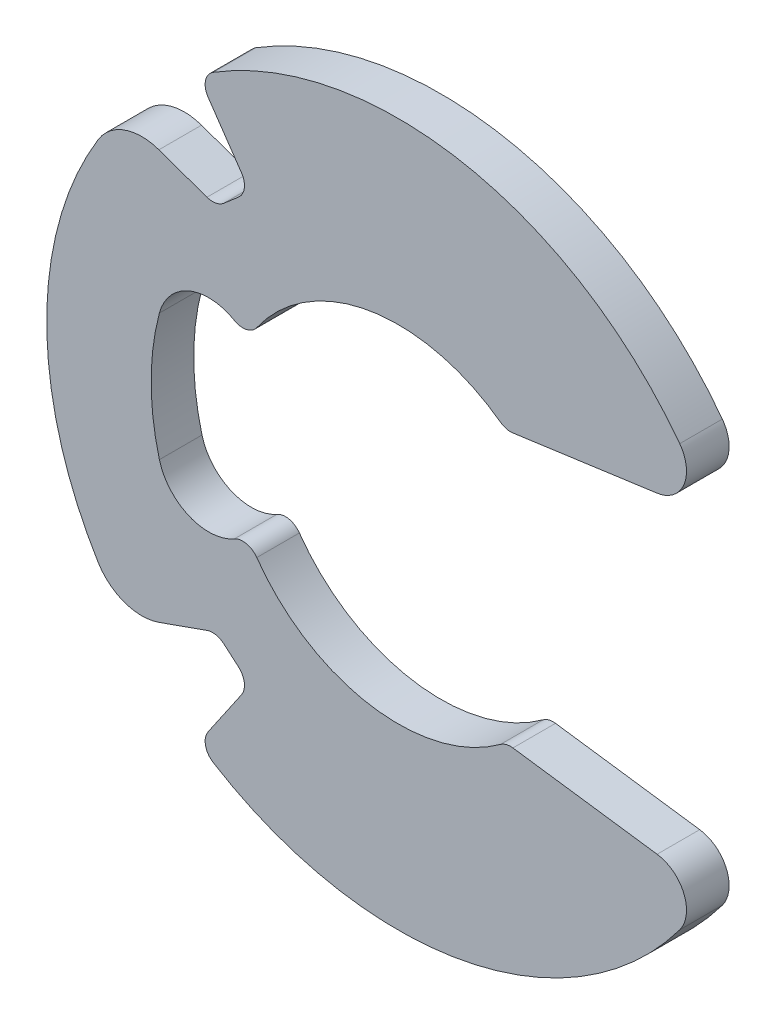
ISO-10303-21;
HEADER;
FILE_DESCRIPTION(('STEP AP214'),'2;1');
FILE_NAME('part.step','',(''),(''),'','','');
FILE_SCHEMA(('AUTOMOTIVE_DESIGN { 1 0 10303 214 1 1 1 1 }'));
ENDSEC;
DATA;
#1=APPLICATION_CONTEXT('core data for automotive mechanical design processes');
#2=APPLICATION_PROTOCOL_DEFINITION('international standard','automotive_design',2000,#1);
#3=PRODUCT_CONTEXT('',#1,'mechanical');
#4=PRODUCT('Part','Part','',(#3));
#5=PRODUCT_RELATED_PRODUCT_CATEGORY('part','',(#4));
#6=PRODUCT_DEFINITION_FORMATION('','',#4);
#7=PRODUCT_DEFINITION_CONTEXT('part definition',#1,'design');
#8=PRODUCT_DEFINITION('design','',#6,#7);
#9=PRODUCT_DEFINITION_SHAPE('','',#8);
#10=(LENGTH_UNIT() NAMED_UNIT(*) SI_UNIT(.MILLI.,.METRE.));
#11=(NAMED_UNIT(*) PLANE_ANGLE_UNIT() SI_UNIT($,.RADIAN.));
#12=(NAMED_UNIT(*) SI_UNIT($,.STERADIAN.) SOLID_ANGLE_UNIT());
#13=UNCERTAINTY_MEASURE_WITH_UNIT(LENGTH_MEASURE(1.E-05),#10,'distance_accuracy_value','');
#14=(GEOMETRIC_REPRESENTATION_CONTEXT(3) GLOBAL_UNCERTAINTY_ASSIGNED_CONTEXT((#13)) GLOBAL_UNIT_ASSIGNED_CONTEXT((#10,
#11,#12)) REPRESENTATION_CONTEXT('',''));
#15=CARTESIAN_POINT('',(0.,0.,0.));
#16=DIRECTION('',(0.,0.,1.));
#17=DIRECTION('',(1.,0.,0.));
#18=AXIS2_PLACEMENT_3D('',#15,#16,#17);
#19=CARTESIAN_POINT('',(0.,0.,1.27));
#20=DIRECTION('',(0.,0.,-1.));
#21=DIRECTION('',(-1.,0.,0.));
#22=AXIS2_PLACEMENT_3D('',#19,#20,#21);
#23=PLANE('',#22);
#24=CARTESIAN_POINT('',(0.,0.,1.27));
#25=DIRECTION('',(0.,0.,-1.));
#26=DIRECTION('',(1.,0.,0.));
#27=AXIS2_PLACEMENT_3D('',#24,#25,#26);
#28=CIRCLE('',#27,10.4775);
#29=CARTESIAN_POINT('',(8.39050144990017,-6.27514873682076,1.27));
#30=VERTEX_POINT('',#29);
#31=CARTESIAN_POINT('',(-5.51465485817055,-8.90879273780998,1.27));
#32=VERTEX_POINT('',#31);
#33=EDGE_CURVE('E431',#30,#32,#28,.T.);
#34=ORIENTED_EDGE('',*,*,#33,.F.);
#35=CARTESIAN_POINT('',(7.57687706687955,-5.66664946537147,1.27));
#36=DIRECTION('',(0.,0.,-1.));
#37=DIRECTION('',(-1.,0.,0.));
#38=AXIS2_PLACEMENT_3D('',#35,#36,#37);
#39=CIRCLE('',#38,1.016);
#40=CARTESIAN_POINT('',(7.71621548730132,-4.66024954258016,1.27));
#41=VERTEX_POINT('',#40);
#42=EDGE_CURVE('E9',#30,#41,#39,.F.);
#43=ORIENTED_EDGE('',*,*,#42,.T.);
#44=DIRECTION('',(0.990551105109562,-0.137144114588364,0.));
#45=VECTOR('',#44,1.);
#46=CARTESIAN_POINT('',(0.,-3.59192148204873,1.27));
#47=LINE('',#46,#45);
#48=CARTESIAN_POINT('',(3.41825205926127,-4.06518646523744,1.27));
#49=VERTEX_POINT('',#48);
#50=EDGE_CURVE('E395',#49,#41,#47,.T.);
#51=ORIENTED_EDGE('',*,*,#50,.F.);
#52=CARTESIAN_POINT('',(3.34858284905039,-4.5683864266331,1.27));
#53=DIRECTION('',(0.,0.,-1.));
#54=DIRECTION('',(-1.,0.,0.));
#55=AXIS2_PLACEMENT_3D('',#52,#53,#54);
#56=CIRCLE('',#55,0.508);
#57=CARTESIAN_POINT('',(3.04826151729699,-4.15866567088125,1.27));
#58=VERTEX_POINT('',#57);
#59=EDGE_CURVE('E358',#49,#58,#56,.F.);
#60=ORIENTED_EDGE('',*,*,#59,.T.);
#61=CARTESIAN_POINT('',(0.,0.,1.27));
#62=DIRECTION('',(0.,0.,-1.));
#63=DIRECTION('',(1.,0.,0.));
#64=AXIS2_PLACEMENT_3D('',#61,#62,#63);
#65=CIRCLE('',#64,5.1562);
#66=CARTESIAN_POINT('',(-4.21618561440545,-2.96819428354689,1.27));
#67=VERTEX_POINT('',#66);
#68=EDGE_CURVE('E435',#58,#67,#65,.T.);
#69=ORIENTED_EDGE('',*,*,#68,.T.);
#70=CARTESIAN_POINT('',(-4.63157335966707,-3.26062721788649,1.27));
#71=DIRECTION('',(0.,0.,-1.));
#72=DIRECTION('',(-1.,0.,0.));
#73=AXIS2_PLACEMENT_3D('',#70,#71,#72);
#74=CIRCLE('',#73,0.508);
#75=CARTESIAN_POINT('',(-4.88521418696267,-2.82047913970278,1.27));
#76=VERTEX_POINT('',#75);
#77=EDGE_CURVE('E367',#67,#76,#74,.F.);
#78=ORIENTED_EDGE('',*,*,#77,.T.);
#79=CARTESIAN_POINT('',(-5.64613666884946,-1.50003490515168,1.27));
#80=DIRECTION('',(0.,0.,-1.));
#81=DIRECTION('',(-1.,0.,0.));
#82=AXIS2_PLACEMENT_3D('',#79,#80,#81);
#83=CIRCLE('',#82,1.524);
#84=CARTESIAN_POINT('',(-7.11904188681019,-1.89134835866951,1.27));
#85=VERTEX_POINT('',#84);
#86=EDGE_CURVE('E260',#76,#85,#83,.T.);
#87=ORIENTED_EDGE('',*,*,#86,.T.);
#88=CARTESIAN_POINT('',(0.,0.,1.27));
#89=DIRECTION('',(0.,0.,-1.));
#90=DIRECTION('',(0.,1.,0.));
#91=AXIS2_PLACEMENT_3D('',#88,#89,#90);
#92=CIRCLE('',#91,7.366);
#93=CARTESIAN_POINT('',(-7.1190418868102,1.89134835866951,1.27));
#94=VERTEX_POINT('',#93);
#95=EDGE_CURVE('E467',#85,#94,#92,.T.);
#96=ORIENTED_EDGE('',*,*,#95,.T.);
#97=CARTESIAN_POINT('',(-5.64613666884946,1.50003490515168,1.27));
#98=DIRECTION('',(0.,0.,-1.));
#99=DIRECTION('',(-1.,0.,0.));
#100=AXIS2_PLACEMENT_3D('',#97,#98,#99);
#101=CIRCLE('',#100,1.524);
#102=CARTESIAN_POINT('',(-4.88521418696268,2.82047913970278,1.27));
#103=VERTEX_POINT('',#102);
#104=EDGE_CURVE('E268',#94,#103,#101,.T.);
#105=ORIENTED_EDGE('',*,*,#104,.T.);
#106=CARTESIAN_POINT('',(-4.63157335966708,3.26062721788649,1.27));
#107=DIRECTION('',(0.,0.,-1.));
#108=DIRECTION('',(-1.,0.,0.));
#109=AXIS2_PLACEMENT_3D('',#106,#107,#108);
#110=CIRCLE('',#109,0.508);
#111=CARTESIAN_POINT('',(-4.21618561440546,2.96819428354689,1.27));
#112=VERTEX_POINT('',#111);
#113=EDGE_CURVE('E372',#103,#112,#110,.F.);
#114=ORIENTED_EDGE('',*,*,#113,.T.);
#115=CARTESIAN_POINT('',(3.048261517297,4.15866567088126,1.27));
#116=VERTEX_POINT('',#115);
#117=EDGE_CURVE('E433',#112,#116,#65,.T.);
#118=ORIENTED_EDGE('',*,*,#117,.T.);
#119=CARTESIAN_POINT('',(3.3485828490504,4.5683864266331,1.27));
#120=DIRECTION('',(0.,0.,-1.));
#121=DIRECTION('',(-1.,0.,0.));
#122=AXIS2_PLACEMENT_3D('',#119,#120,#121);
#123=CIRCLE('',#122,0.508);
#124=CARTESIAN_POINT('',(3.41825205926129,4.06518646523744,1.27));
#125=VERTEX_POINT('',#124);
#126=EDGE_CURVE('E286',#116,#125,#123,.F.);
#127=ORIENTED_EDGE('',*,*,#126,.T.);
#128=DIRECTION('',(-0.990551105109562,-0.137144114588364,0.));
#129=VECTOR('',#128,1.);
#130=CARTESIAN_POINT('',(11.2983179723503,5.15619999999999,1.27));
#131=LINE('',#130,#129);
#132=CARTESIAN_POINT('',(7.71621548730134,4.66024954258016,1.27));
#133=VERTEX_POINT('',#132);
#134=EDGE_CURVE('E410',#133,#125,#131,.T.);
#135=ORIENTED_EDGE('',*,*,#134,.F.);
#136=CARTESIAN_POINT('',(7.57687706687956,5.66664946537147,1.27));
#137=DIRECTION('',(0.,0.,-1.));
#138=DIRECTION('',(-1.,0.,0.));
#139=AXIS2_PLACEMENT_3D('',#136,#137,#138);
#140=CIRCLE('',#139,1.016);
#141=CARTESIAN_POINT('',(8.39050144990018,6.27514873682076,1.27));
#142=VERTEX_POINT('',#141);
#143=EDGE_CURVE('E381',#133,#142,#140,.F.);
#144=ORIENTED_EDGE('',*,*,#143,.T.);
#145=CARTESIAN_POINT('',(-5.51465485817056,8.90879273780999,1.27));
#146=VERTEX_POINT('',#145);
#147=EDGE_CURVE('E430',#146,#142,#28,.T.);
#148=ORIENTED_EDGE('',*,*,#147,.F.);
#149=CARTESIAN_POINT('',(-5.24727765292592,8.47685127173435,1.27));
#150=DIRECTION('',(0.,0.,-1.));
#151=DIRECTION('',(-1.,0.,0.));
#152=AXIS2_PLACEMENT_3D('',#149,#150,#151);
#153=CIRCLE('',#152,0.508);
#154=CARTESIAN_POINT('',(-5.6664647231543,8.18989099547063,1.27));
#155=VERTEX_POINT('',#154);
#156=EDGE_CURVE('E344',#146,#155,#153,.F.);
#157=ORIENTED_EDGE('',*,*,#156,.T.);
#158=DIRECTION('',(0.564882433590001,-0.825171398087354,0.));
#159=VECTOR('',#158,1.);
#160=CARTESIAN_POINT('',(-7.96096866359448,11.541666359447,1.27));
#161=LINE('',#160,#159);
#162=CARTESIAN_POINT('',(-4.67174469224146,6.73681957776462,1.27));
#163=VERTEX_POINT('',#162);
#164=EDGE_CURVE('E464',#155,#163,#161,.T.);
#165=ORIENTED_EDGE('',*,*,#164,.T.);
#166=CARTESIAN_POINT('',(-5.09093176246983,6.4498593015009,1.27));
#167=DIRECTION('',(0.,0.,-1.));
#168=DIRECTION('',(-1.,0.,0.));
#169=AXIS2_PLACEMENT_3D('',#166,#167,#168);
#170=CIRCLE('',#169,0.508);
#171=CARTESIAN_POINT('',(-4.75923843445855,6.0650950410078,1.27));
#172=VERTEX_POINT('',#171);
#173=EDGE_CURVE('E316',#163,#172,#170,.T.);
#174=ORIENTED_EDGE('',*,*,#173,.T.);
#175=DIRECTION('',(-0.757409961600578,-0.652939622069462,0.));
#176=VECTOR('',#175,1.);
#177=CARTESIAN_POINT('',(-4.41503502304148,6.36182211981562,1.27));
#178=LINE('',#177,#176);
#179=CARTESIAN_POINT('',(-5.19974545035898,5.68534761350743,1.27));
#180=VERTEX_POINT('',#179);
#181=EDGE_CURVE('E459',#172,#180,#178,.T.);
#182=ORIENTED_EDGE('',*,*,#181,.T.);
#183=CARTESIAN_POINT('',(-5.53143877837027,6.07011187400052,1.27));
#184=DIRECTION('',(0.,0.,-1.));
#185=DIRECTION('',(-1.,0.,0.));
#186=AXIS2_PLACEMENT_3D('',#183,#184,#185);
#187=CIRCLE('',#186,0.508);
#188=CARTESIAN_POINT('',(-5.70123922502142,5.59133028672186,1.27));
#189=VERTEX_POINT('',#188);
#190=EDGE_CURVE('E307',#180,#189,#187,.T.);
#191=ORIENTED_EDGE('',*,*,#190,.T.);
#192=DIRECTION('',(-0.942483439524914,0.334252847738487,0.));
#193=VECTOR('',#192,1.);
#194=CARTESIAN_POINT('',(-5.42319262672811,5.49272073732714,1.27));
#195=LINE('',#194,#193);
#196=CARTESIAN_POINT('',(-7.13394241485243,6.09944013892937,1.27));
#197=VERTEX_POINT('',#196);
#198=EDGE_CURVE('E453',#189,#197,#195,.T.);
#199=ORIENTED_EDGE('',*,*,#198,.T.);
#200=CARTESIAN_POINT('',(-7.64334375480589,4.6630953770934,1.27));
#201=DIRECTION('',(0.,0.,-1.));
#202=DIRECTION('',(-1.,0.,0.));
#203=AXIS2_PLACEMENT_3D('',#200,#201,#202);
#204=CIRCLE('',#203,1.524);
#205=CARTESIAN_POINT('',(-8.94433843647498,5.45681373915185,1.27));
#206=VERTEX_POINT('',#205);
#207=EDGE_CURVE('E281',#197,#206,#204,.F.);
#208=ORIENTED_EDGE('',*,*,#207,.T.);
#209=CARTESIAN_POINT('',(-8.94433843647497,-5.45681373915185,1.27));
#210=VERTEX_POINT('',#209);
#211=EDGE_CURVE('E434',#210,#206,#28,.T.);
#212=ORIENTED_EDGE('',*,*,#211,.F.);
#213=CARTESIAN_POINT('',(-7.64334375480588,-4.6630953770934,1.27));
#214=DIRECTION('',(0.,0.,-1.));
#215=DIRECTION('',(-1.,0.,0.));
#216=AXIS2_PLACEMENT_3D('',#213,#214,#215);
#217=CIRCLE('',#216,1.524);
#218=CARTESIAN_POINT('',(-7.13394241485243,-6.09944013892937,1.27));
#219=VERTEX_POINT('',#218);
#220=EDGE_CURVE('E255',#210,#219,#217,.F.);
#221=ORIENTED_EDGE('',*,*,#220,.T.);
#222=DIRECTION('',(-0.942483439524914,-0.334252847738487,0.));
#223=VECTOR('',#222,1.);
#224=CARTESIAN_POINT('',(-5.42319262672811,-5.49272073732714,1.27));
#225=LINE('',#224,#223);
#226=CARTESIAN_POINT('',(-5.70123922502142,-5.59133028672186,1.27));
#227=VERTEX_POINT('',#226);
#228=EDGE_CURVE('E226',#227,#219,#225,.T.);
#229=ORIENTED_EDGE('',*,*,#228,.F.);
#230=CARTESIAN_POINT('',(-5.53143877837027,-6.07011187400052,1.27));
#231=DIRECTION('',(0.,0.,-1.));
#232=DIRECTION('',(-1.,0.,0.));
#233=AXIS2_PLACEMENT_3D('',#230,#231,#232);
#234=CIRCLE('',#233,0.508);
#235=CARTESIAN_POINT('',(-5.19974545035898,-5.68534761350743,1.27));
#236=VERTEX_POINT('',#235);
#237=EDGE_CURVE('E298',#227,#236,#234,.T.);
#238=ORIENTED_EDGE('',*,*,#237,.T.);
#239=DIRECTION('',(-0.757409961600578,0.652939622069462,0.));
#240=VECTOR('',#239,1.);
#241=CARTESIAN_POINT('',(-4.41503502304148,-6.36182211981562,1.27));
#242=LINE('',#241,#240);
#243=CARTESIAN_POINT('',(-4.75923843445855,-6.0650950410078,1.27));
#244=VERTEX_POINT('',#243);
#245=EDGE_CURVE('E420',#244,#236,#242,.T.);
#246=ORIENTED_EDGE('',*,*,#245,.F.);
#247=CARTESIAN_POINT('',(-5.09093176246983,-6.4498593015009,1.27));
#248=DIRECTION('',(0.,0.,-1.));
#249=DIRECTION('',(-1.,0.,0.));
#250=AXIS2_PLACEMENT_3D('',#247,#248,#249);
#251=CIRCLE('',#250,0.508);
#252=CARTESIAN_POINT('',(-4.67174469224146,-6.73681957776462,1.27));
#253=VERTEX_POINT('',#252);
#254=EDGE_CURVE('E325',#244,#253,#251,.T.);
#255=ORIENTED_EDGE('',*,*,#254,.T.);
#256=DIRECTION('',(0.564882433590001,0.825171398087354,0.));
#257=VECTOR('',#256,1.);
#258=CARTESIAN_POINT('',(-7.96096866359448,-11.541666359447,1.27));
#259=LINE('',#258,#257);
#260=CARTESIAN_POINT('',(-5.66646472315429,-8.18989099547062,1.27));
#261=VERTEX_POINT('',#260);
#262=EDGE_CURVE('E450',#261,#253,#259,.T.);
#263=ORIENTED_EDGE('',*,*,#262,.F.);
#264=CARTESIAN_POINT('',(-5.24727765292592,-8.47685127173434,1.27));
#265=DIRECTION('',(0.,0.,-1.));
#266=DIRECTION('',(-1.,0.,0.));
#267=AXIS2_PLACEMENT_3D('',#264,#265,#266);
#268=CIRCLE('',#267,0.508);
#269=EDGE_CURVE('E333',#261,#32,#268,.F.);
#270=ORIENTED_EDGE('',*,*,#269,.T.);
#271=EDGE_LOOP('',(#34,#43,#51,#60,#69,#78,#87,#96,#105,#114,#118,#127,#135,#144,#148,#157,#165,
#174,#182,#191,#199,#208,#212,#221,#229,#238,#246,#255,#263,#270));
#272=FACE_BOUND('',#271,.T.);
#273=ADVANCED_FACE('F14',(#272),#23,.F.);
#274=CARTESIAN_POINT('',(0.,0.,0.));
#275=DIRECTION('',(0.,0.,-1.));
#276=DIRECTION('',(-1.,0.,0.));
#277=AXIS2_PLACEMENT_3D('',#274,#275,#276);
#278=PLANE('',#277);
#279=DIRECTION('',(-0.990551105109562,0.137144114588364,0.));
#280=VECTOR('',#279,1.);
#281=CARTESIAN_POINT('',(-0.487956262792466,-3.52436279752117,0.));
#282=LINE('',#281,#280);
#283=CARTESIAN_POINT('',(7.71621548730133,-4.66024954258016,0.));
#284=VERTEX_POINT('',#283);
#285=CARTESIAN_POINT('',(3.41825205926127,-4.06518646523744,0.));
#286=VERTEX_POINT('',#285);
#287=EDGE_CURVE('E235',#284,#286,#282,.T.);
#288=ORIENTED_EDGE('',*,*,#287,.F.);
#289=CARTESIAN_POINT('',(7.57687706687955,-5.66664946537147,0.));
#290=DIRECTION('',(0.,0.,-1.));
#291=DIRECTION('',(-1.,0.,0.));
#292=AXIS2_PLACEMENT_3D('',#289,#290,#291);
#293=CIRCLE('',#292,1.016);
#294=CARTESIAN_POINT('',(8.39050144990017,-6.27514873682076,0.));
#295=VERTEX_POINT('',#294);
#296=EDGE_CURVE('E36',#284,#295,#293,.T.);
#297=ORIENTED_EDGE('',*,*,#296,.T.);
#298=CARTESIAN_POINT('',(0.,0.,0.));
#299=DIRECTION('',(0.,0.,-1.));
#300=DIRECTION('',(1.,0.,0.));
#301=AXIS2_PLACEMENT_3D('',#298,#299,#300);
#302=CIRCLE('',#301,10.4775);
#303=CARTESIAN_POINT('',(-5.51465485817055,-8.90879273780998,0.));
#304=VERTEX_POINT('',#303);
#305=EDGE_CURVE('E424',#295,#304,#302,.T.);
#306=ORIENTED_EDGE('',*,*,#305,.T.);
#307=CARTESIAN_POINT('',(-5.24727765292592,-8.47685127173434,0.));
#308=DIRECTION('',(0.,0.,-1.));
#309=DIRECTION('',(-1.,0.,0.));
#310=AXIS2_PLACEMENT_3D('',#307,#308,#309);
#311=CIRCLE('',#310,0.508);
#312=CARTESIAN_POINT('',(-5.6664647231543,-8.18989099547062,0.));
#313=VERTEX_POINT('',#312);
#314=EDGE_CURVE('E339',#304,#313,#311,.T.);
#315=ORIENTED_EDGE('',*,*,#314,.T.);
#316=DIRECTION('',(-0.56488243359,-0.825171398087354,0.));
#317=VECTOR('',#316,1.);
#318=CARTESIAN_POINT('',(-0.0408287063206822,0.0279498526490687,0.));
#319=LINE('',#318,#317);
#320=CARTESIAN_POINT('',(-4.67174469224146,-6.73681957776462,0.));
#321=VERTEX_POINT('',#320);
#322=EDGE_CURVE('E238',#321,#313,#319,.T.);
#323=ORIENTED_EDGE('',*,*,#322,.F.);
#324=CARTESIAN_POINT('',(-5.09093176246983,-6.4498593015009,0.));
#325=DIRECTION('',(0.,0.,-1.));
#326=DIRECTION('',(-1.,0.,0.));
#327=AXIS2_PLACEMENT_3D('',#324,#325,#326);
#328=CIRCLE('',#327,0.508);
#329=CARTESIAN_POINT('',(-4.75923843445854,-6.0650950410078,0.));
#330=VERTEX_POINT('',#329);
#331=EDGE_CURVE('E328',#321,#330,#328,.F.);
#332=ORIENTED_EDGE('',*,*,#331,.T.);
#333=DIRECTION('',(0.757409961600578,-0.652939622069462,0.));
#334=VECTOR('',#333,1.);
#335=CARTESIAN_POINT('',(-5.02845697562567,-5.8330100917258,0.));
#336=LINE('',#335,#334);
#337=CARTESIAN_POINT('',(-5.19974545035898,-5.68534761350743,0.));
#338=VERTEX_POINT('',#337);
#339=EDGE_CURVE('E234',#338,#330,#336,.T.);
#340=ORIENTED_EDGE('',*,*,#339,.F.);
#341=CARTESIAN_POINT('',(-5.53143877837027,-6.07011187400052,0.));
#342=DIRECTION('',(0.,0.,-1.));
#343=DIRECTION('',(-1.,0.,0.));
#344=AXIS2_PLACEMENT_3D('',#341,#342,#343);
#345=CIRCLE('',#344,0.508);
#346=CARTESIAN_POINT('',(-5.70123922502142,-5.59133028672186,0.));
#347=VERTEX_POINT('',#346);
#348=EDGE_CURVE('E233',#338,#347,#345,.F.);
#349=ORIENTED_EDGE('',*,*,#348,.T.);
#350=DIRECTION('',(0.942483439524914,0.334252847738487,0.));
#351=VECTOR('',#350,1.);
#352=CARTESIAN_POINT('',(1.12445357189555,-3.17059039944317,0.));
#353=LINE('',#352,#351);
#354=CARTESIAN_POINT('',(-7.13394241485243,-6.09944013892937,0.));
#355=VERTEX_POINT('',#354);
#356=EDGE_CURVE('E223',#355,#347,#353,.T.);
#357=ORIENTED_EDGE('',*,*,#356,.F.);
#358=CARTESIAN_POINT('',(-7.64334375480588,-4.6630953770934,0.));
#359=DIRECTION('',(0.,0.,-1.));
#360=DIRECTION('',(-1.,0.,0.));
#361=AXIS2_PLACEMENT_3D('',#358,#359,#360);
#362=CIRCLE('',#361,1.524);
#363=CARTESIAN_POINT('',(-8.94433843647497,-5.45681373915185,0.));
#364=VERTEX_POINT('',#363);
#365=EDGE_CURVE('E209',#355,#364,#362,.T.);
#366=ORIENTED_EDGE('',*,*,#365,.T.);
#367=CARTESIAN_POINT('',(-8.94433843647498,5.45681373915185,0.));
#368=VERTEX_POINT('',#367);
#369=EDGE_CURVE('E428',#364,#368,#302,.T.);
#370=ORIENTED_EDGE('',*,*,#369,.T.);
#371=CARTESIAN_POINT('',(-7.64334375480589,4.6630953770934,0.));
#372=DIRECTION('',(0.,0.,-1.));
#373=DIRECTION('',(-1.,0.,0.));
#374=AXIS2_PLACEMENT_3D('',#371,#372,#373);
#375=CIRCLE('',#374,1.524);
#376=CARTESIAN_POINT('',(-7.13394241485243,6.09944013892937,0.));
#377=VERTEX_POINT('',#376);
#378=EDGE_CURVE('E276',#368,#377,#375,.T.);
#379=ORIENTED_EDGE('',*,*,#378,.T.);
#380=DIRECTION('',(0.942483439524914,-0.334252847738487,0.));
#381=VECTOR('',#380,1.);
#382=CARTESIAN_POINT('',(1.12445357189554,3.17059039944317,0.));
#383=LINE('',#382,#381);
#384=CARTESIAN_POINT('',(-5.70123922502143,5.59133028672186,0.));
#385=VERTEX_POINT('',#384);
#386=EDGE_CURVE('E250',#377,#385,#383,.T.);
#387=ORIENTED_EDGE('',*,*,#386,.T.);
#388=CARTESIAN_POINT('',(-5.53143877837027,6.07011187400052,0.));
#389=DIRECTION('',(0.,0.,-1.));
#390=DIRECTION('',(-1.,0.,0.));
#391=AXIS2_PLACEMENT_3D('',#388,#389,#390);
#392=CIRCLE('',#391,0.508);
#393=CARTESIAN_POINT('',(-5.19974545035898,5.68534761350743,0.));
#394=VERTEX_POINT('',#393);
#395=EDGE_CURVE('E309',#385,#394,#392,.F.);
#396=ORIENTED_EDGE('',*,*,#395,.T.);
#397=DIRECTION('',(0.757409961600578,0.652939622069462,0.));
#398=VECTOR('',#397,1.);
#399=CARTESIAN_POINT('',(-5.02845697562567,5.8330100917258,0.));
#400=LINE('',#399,#398);
#401=CARTESIAN_POINT('',(-4.75923843445855,6.0650950410078,0.));
#402=VERTEX_POINT('',#401);
#403=EDGE_CURVE('E247',#394,#402,#400,.T.);
#404=ORIENTED_EDGE('',*,*,#403,.T.);
#405=CARTESIAN_POINT('',(-5.09093176246983,6.4498593015009,0.));
#406=DIRECTION('',(0.,0.,-1.));
#407=DIRECTION('',(-1.,0.,0.));
#408=AXIS2_PLACEMENT_3D('',#405,#406,#407);
#409=CIRCLE('',#408,0.508);
#410=CARTESIAN_POINT('',(-4.67174469224146,6.73681957776462,0.));
#411=VERTEX_POINT('',#410);
#412=EDGE_CURVE('E318',#402,#411,#409,.F.);
#413=ORIENTED_EDGE('',*,*,#412,.T.);
#414=DIRECTION('',(-0.564882433590001,0.825171398087354,0.));
#415=VECTOR('',#414,1.);
#416=CARTESIAN_POINT('',(-0.0408287063206891,-0.0279498526490583,0.));
#417=LINE('',#416,#415);
#418=CARTESIAN_POINT('',(-5.6664647231543,8.18989099547063,0.));
#419=VERTEX_POINT('',#418);
#420=EDGE_CURVE('E244',#411,#419,#417,.T.);
#421=ORIENTED_EDGE('',*,*,#420,.T.);
#422=CARTESIAN_POINT('',(-5.24727765292592,8.47685127173435,0.));
#423=DIRECTION('',(0.,0.,-1.));
#424=DIRECTION('',(-1.,0.,0.));
#425=AXIS2_PLACEMENT_3D('',#422,#423,#424);
#426=CIRCLE('',#425,0.508);
#427=CARTESIAN_POINT('',(-5.51465485817056,8.90879273780999,0.));
#428=VERTEX_POINT('',#427);
#429=EDGE_CURVE('E348',#419,#428,#426,.T.);
#430=ORIENTED_EDGE('',*,*,#429,.T.);
#431=CARTESIAN_POINT('',(8.39050144990018,6.27514873682076,0.));
#432=VERTEX_POINT('',#431);
#433=EDGE_CURVE('E417',#428,#432,#302,.T.);
#434=ORIENTED_EDGE('',*,*,#433,.T.);
#435=CARTESIAN_POINT('',(7.57687706687956,5.66664946537147,0.));
#436=DIRECTION('',(0.,0.,-1.));
#437=DIRECTION('',(-1.,0.,0.));
#438=AXIS2_PLACEMENT_3D('',#435,#436,#437);
#439=CIRCLE('',#438,1.016);
#440=CARTESIAN_POINT('',(7.71621548730134,4.66024954258016,0.));
#441=VERTEX_POINT('',#440);
#442=EDGE_CURVE('E385',#432,#441,#439,.T.);
#443=ORIENTED_EDGE('',*,*,#442,.T.);
#444=DIRECTION('',(0.990551105109562,0.137144114588364,0.));
#445=VECTOR('',#444,1.);
#446=CARTESIAN_POINT('',(-0.487956262792459,3.52436279752117,0.));
#447=LINE('',#446,#445);
#448=CARTESIAN_POINT('',(3.41825205926129,4.06518646523744,0.));
#449=VERTEX_POINT('',#448);
#450=EDGE_CURVE('E240',#449,#441,#447,.T.);
#451=ORIENTED_EDGE('',*,*,#450,.F.);
#452=CARTESIAN_POINT('',(3.3485828490504,4.5683864266331,0.));
#453=DIRECTION('',(0.,0.,-1.));
#454=DIRECTION('',(-1.,0.,0.));
#455=AXIS2_PLACEMENT_3D('',#452,#453,#454);
#456=CIRCLE('',#455,0.508);
#457=CARTESIAN_POINT('',(3.048261517297,4.15866567088126,0.));
#458=VERTEX_POINT('',#457);
#459=EDGE_CURVE('E291',#449,#458,#456,.T.);
#460=ORIENTED_EDGE('',*,*,#459,.T.);
#461=CARTESIAN_POINT('',(0.,0.,0.));
#462=DIRECTION('',(0.,0.,-1.));
#463=DIRECTION('',(1.,0.,0.));
#464=AXIS2_PLACEMENT_3D('',#461,#462,#463);
#465=CIRCLE('',#464,5.1562);
#466=CARTESIAN_POINT('',(-4.21618561440546,2.96819428354689,0.));
#467=VERTEX_POINT('',#466);
#468=EDGE_CURVE('E427',#467,#458,#465,.T.);
#469=ORIENTED_EDGE('',*,*,#468,.F.);
#470=CARTESIAN_POINT('',(-4.63157335966708,3.26062721788649,0.));
#471=DIRECTION('',(0.,0.,-1.));
#472=DIRECTION('',(-1.,0.,0.));
#473=AXIS2_PLACEMENT_3D('',#470,#471,#472);
#474=CIRCLE('',#473,0.508);
#475=CARTESIAN_POINT('',(-4.88521418696268,2.82047913970278,0.));
#476=VERTEX_POINT('',#475);
#477=EDGE_CURVE('E376',#467,#476,#474,.T.);
#478=ORIENTED_EDGE('',*,*,#477,.T.);
#479=CARTESIAN_POINT('',(-5.64613666884946,1.50003490515168,0.));
#480=DIRECTION('',(0.,0.,-1.));
#481=DIRECTION('',(-1.,0.,0.));
#482=AXIS2_PLACEMENT_3D('',#479,#480,#481);
#483=CIRCLE('',#482,1.524);
#484=CARTESIAN_POINT('',(-7.1190418868102,1.89134835866951,0.));
#485=VERTEX_POINT('',#484);
#486=EDGE_CURVE('E271',#476,#485,#483,.F.);
#487=ORIENTED_EDGE('',*,*,#486,.T.);
#488=CARTESIAN_POINT('',(0.,0.,0.));
#489=DIRECTION('',(0.,0.,-1.));
#490=DIRECTION('',(-1.,0.,0.));
#491=AXIS2_PLACEMENT_3D('',#488,#489,#490);
#492=CIRCLE('',#491,7.366);
#493=CARTESIAN_POINT('',(-7.11904188681019,-1.89134835866951,0.));
#494=VERTEX_POINT('',#493);
#495=EDGE_CURVE('E228',#485,#494,#492,.F.);
#496=ORIENTED_EDGE('',*,*,#495,.T.);
#497=CARTESIAN_POINT('',(-5.64613666884946,-1.50003490515168,0.));
#498=DIRECTION('',(0.,0.,-1.));
#499=DIRECTION('',(-1.,0.,0.));
#500=AXIS2_PLACEMENT_3D('',#497,#498,#499);
#501=CIRCLE('',#500,1.524);
#502=CARTESIAN_POINT('',(-4.88521418696267,-2.82047913970278,0.));
#503=VERTEX_POINT('',#502);
#504=EDGE_CURVE('E262',#494,#503,#501,.F.);
#505=ORIENTED_EDGE('',*,*,#504,.T.);
#506=CARTESIAN_POINT('',(-4.63157335966707,-3.26062721788649,0.));
#507=DIRECTION('',(0.,0.,-1.));
#508=DIRECTION('',(-1.,0.,0.));
#509=AXIS2_PLACEMENT_3D('',#506,#507,#508);
#510=CIRCLE('',#509,0.508);
#511=CARTESIAN_POINT('',(-4.21618561440545,-2.96819428354689,0.));
#512=VERTEX_POINT('',#511);
#513=EDGE_CURVE('E363',#503,#512,#510,.T.);
#514=ORIENTED_EDGE('',*,*,#513,.T.);
#515=CARTESIAN_POINT('',(3.04826151729699,-4.15866567088125,0.));
#516=VERTEX_POINT('',#515);
#517=EDGE_CURVE('E401',#516,#512,#465,.T.);
#518=ORIENTED_EDGE('',*,*,#517,.F.);
#519=CARTESIAN_POINT('',(3.34858284905039,-4.5683864266331,0.));
#520=DIRECTION('',(0.,0.,-1.));
#521=DIRECTION('',(-1.,0.,0.));
#522=AXIS2_PLACEMENT_3D('',#519,#520,#521);
#523=CIRCLE('',#522,0.508);
#524=EDGE_CURVE('E353',#516,#286,#523,.T.);
#525=ORIENTED_EDGE('',*,*,#524,.T.);
#526=EDGE_LOOP('',(#288,#297,#306,#315,#323,#332,#340,#349,#357,#366,#370,#379,#387,#396,#404,
#413,#421,#430,#434,#443,#451,#460,#469,#478,#487,#496,#505,#514,#518,#525));
#527=FACE_BOUND('',#526,.T.);
#528=ADVANCED_FACE('F230',(#527),#278,.T.);
#529=CARTESIAN_POINT('',(0.,0.,1.27));
#530=DIRECTION('',(0.,0.,-1.));
#531=DIRECTION('',(-1.,0.,0.));
#532=AXIS2_PLACEMENT_3D('',#529,#530,#531);
#533=CYLINDRICAL_SURFACE('',#532,5.1562);
#534=ORIENTED_EDGE('',*,*,#117,.F.);
#535=DIRECTION('',(0.,0.,-1.));
#536=VECTOR('',#535,1.);
#537=CARTESIAN_POINT('',(-4.21618561440546,2.96819428354689,1.27));
#538=LINE('',#537,#536);
#539=EDGE_CURVE('E374',#112,#467,#538,.T.);
#540=ORIENTED_EDGE('',*,*,#539,.T.);
#541=ORIENTED_EDGE('',*,*,#468,.T.);
#542=DIRECTION('',(0.,0.,-1.));
#543=VECTOR('',#542,1.);
#544=CARTESIAN_POINT('',(3.048261517297,4.15866567088126,1.27));
#545=LINE('',#544,#543);
#546=EDGE_CURVE('E283',#458,#116,#545,.F.);
#547=ORIENTED_EDGE('',*,*,#546,.T.);
#548=EDGE_LOOP('',(#534,#540,#541,#547));
#549=FACE_BOUND('',#548,.T.);
#550=ADVANCED_FACE('F494',(#549),#533,.F.);
#551=ORIENTED_EDGE('',*,*,#517,.T.);
#552=DIRECTION('',(0.,0.,-1.));
#553=VECTOR('',#552,1.);
#554=CARTESIAN_POINT('',(-4.21618561440545,-2.96819428354689,1.27));
#555=LINE('',#554,#553);
#556=EDGE_CURVE('E365',#512,#67,#555,.F.);
#557=ORIENTED_EDGE('',*,*,#556,.T.);
#558=ORIENTED_EDGE('',*,*,#68,.F.);
#559=DIRECTION('',(0.,0.,-1.));
#560=VECTOR('',#559,1.);
#561=CARTESIAN_POINT('',(3.04826151729699,-4.15866567088125,1.27));
#562=LINE('',#561,#560);
#563=EDGE_CURVE('E350',#58,#516,#562,.T.);
#564=ORIENTED_EDGE('',*,*,#563,.T.);
#565=EDGE_LOOP('',(#551,#557,#558,#564));
#566=FACE_BOUND('',#565,.T.);
#567=ADVANCED_FACE('F580',(#566),#533,.F.);
#568=CARTESIAN_POINT('',(0.,0.,1.27));
#569=DIRECTION('',(0.,0.,-1.));
#570=DIRECTION('',(-1.,0.,0.));
#571=AXIS2_PLACEMENT_3D('',#568,#569,#570);
#572=CYLINDRICAL_SURFACE('',#571,10.4775);
#573=ORIENTED_EDGE('',*,*,#147,.T.);
#574=DIRECTION('',(0.,0.,-1.));
#575=VECTOR('',#574,1.);
#576=CARTESIAN_POINT('',(8.39050144990018,6.27514873682076,1.27));
#577=LINE('',#576,#575);
#578=EDGE_CURVE('E383',#142,#432,#577,.T.);
#579=ORIENTED_EDGE('',*,*,#578,.T.);
#580=ORIENTED_EDGE('',*,*,#433,.F.);
#581=DIRECTION('',(0.,0.,-1.));
#582=VECTOR('',#581,1.);
#583=CARTESIAN_POINT('',(-5.51465485817056,8.90879273780999,1.27));
#584=LINE('',#583,#582);
#585=EDGE_CURVE('E341',#428,#146,#584,.F.);
#586=ORIENTED_EDGE('',*,*,#585,.T.);
#587=EDGE_LOOP('',(#573,#579,#580,#586));
#588=FACE_BOUND('',#587,.T.);
#589=ADVANCED_FACE('F16',(#588),#572,.T.);
#590=ORIENTED_EDGE('',*,*,#211,.T.);
#591=DIRECTION('',(0.,0.,-1.));
#592=VECTOR('',#591,1.);
#593=CARTESIAN_POINT('',(-8.94433843647498,5.45681373915186,1.27));
#594=LINE('',#593,#592);
#595=EDGE_CURVE('E273',#206,#368,#594,.T.);
#596=ORIENTED_EDGE('',*,*,#595,.T.);
#597=ORIENTED_EDGE('',*,*,#369,.F.);
#598=DIRECTION('',(0.,0.,-1.));
#599=VECTOR('',#598,1.);
#600=CARTESIAN_POINT('',(-8.94433843647497,-5.45681373915186,1.27));
#601=LINE('',#600,#599);
#602=EDGE_CURVE('E214',#364,#210,#601,.F.);
#603=ORIENTED_EDGE('',*,*,#602,.T.);
#604=EDGE_LOOP('',(#590,#596,#597,#603));
#605=FACE_BOUND('',#604,.T.);
#606=ADVANCED_FACE('F522',(#605),#572,.T.);
#607=ORIENTED_EDGE('',*,*,#305,.F.);
#608=DIRECTION('',(0.,0.,-1.));
#609=VECTOR('',#608,1.);
#610=CARTESIAN_POINT('',(8.39050144990017,-6.27514873682076,1.27));
#611=LINE('',#610,#609);
#612=EDGE_CURVE('E22',#295,#30,#611,.F.);
#613=ORIENTED_EDGE('',*,*,#612,.T.);
#614=ORIENTED_EDGE('',*,*,#33,.T.);
#615=DIRECTION('',(0.,0.,-1.));
#616=VECTOR('',#615,1.);
#617=CARTESIAN_POINT('',(-5.51465485817055,-8.90879273780998,1.27));
#618=LINE('',#617,#616);
#619=EDGE_CURVE('E336',#32,#304,#618,.T.);
#620=ORIENTED_EDGE('',*,*,#619,.T.);
#621=EDGE_LOOP('',(#607,#613,#614,#620));
#622=FACE_BOUND('',#621,.T.);
#623=ADVANCED_FACE('F588',(#622),#572,.T.);
#624=CARTESIAN_POINT('',(0.,-3.59192148204873,-28.9774986298856));
#625=DIRECTION('',(-0.137144114588364,-0.990551105109562,0.));
#626=DIRECTION('',(0.990551105109562,-0.137144114588364,0.));
#627=AXIS2_PLACEMENT_3D('',#624,#625,#626);
#628=PLANE('',#627);
#629=ORIENTED_EDGE('',*,*,#50,.T.);
#630=DIRECTION('',(0.,0.,1.));
#631=VECTOR('',#630,1.);
#632=CARTESIAN_POINT('',(7.71621548730132,-4.66024954258016,0.));
#633=LINE('',#632,#631);
#634=EDGE_CURVE('E387',#41,#284,#633,.F.);
#635=ORIENTED_EDGE('',*,*,#634,.T.);
#636=ORIENTED_EDGE('',*,*,#287,.T.);
#637=DIRECTION('',(0.,0.,-1.));
#638=VECTOR('',#637,1.);
#639=CARTESIAN_POINT('',(3.41825205926127,-4.06518646523744,-28.9774986298856));
#640=LINE('',#639,#638);
#641=EDGE_CURVE('E356',#286,#49,#640,.F.);
#642=ORIENTED_EDGE('',*,*,#641,.T.);
#643=EDGE_LOOP('',(#629,#635,#636,#642));
#644=FACE_BOUND('',#643,.T.);
#645=ADVANCED_FACE('F393',(#644),#628,.F.);
#646=CARTESIAN_POINT('',(11.2983179723503,5.15619999999999,-28.9774986298856));
#647=DIRECTION('',(-0.137144114588364,0.990551105109562,0.));
#648=DIRECTION('',(-0.990551105109562,-0.137144114588364,0.));
#649=AXIS2_PLACEMENT_3D('',#646,#647,#648);
#650=PLANE('',#649);
#651=ORIENTED_EDGE('',*,*,#450,.T.);
#652=DIRECTION('',(0.,0.,1.));
#653=VECTOR('',#652,1.);
#654=CARTESIAN_POINT('',(7.71621548730134,4.66024954258016,1.27));
#655=LINE('',#654,#653);
#656=EDGE_CURVE('E378',#441,#133,#655,.T.);
#657=ORIENTED_EDGE('',*,*,#656,.T.);
#658=ORIENTED_EDGE('',*,*,#134,.T.);
#659=DIRECTION('',(0.,0.,-1.));
#660=VECTOR('',#659,1.);
#661=CARTESIAN_POINT('',(3.41825205926129,4.06518646523744,-28.9774986298856));
#662=LINE('',#661,#660);
#663=EDGE_CURVE('E289',#125,#449,#662,.T.);
#664=ORIENTED_EDGE('',*,*,#663,.T.);
#665=EDGE_LOOP('',(#651,#657,#658,#664));
#666=FACE_BOUND('',#665,.T.);
#667=ADVANCED_FACE('F505',(#666),#650,.F.);
#668=CARTESIAN_POINT('',(-7.96096866359448,-11.541666359447,-28.9619533727259));
#669=DIRECTION('',(0.825171398087354,-0.56488243359,0.));
#670=DIRECTION('',(0.56488243359,0.825171398087354,0.));
#671=AXIS2_PLACEMENT_3D('',#668,#669,#670);
#672=PLANE('',#671);
#673=ORIENTED_EDGE('',*,*,#322,.T.);
#674=DIRECTION('',(0.,0.,1.));
#675=VECTOR('',#674,1.);
#676=CARTESIAN_POINT('',(-5.66646472315429,-8.18989099547062,1.27));
#677=LINE('',#676,#675);
#678=EDGE_CURVE('E330',#313,#261,#677,.T.);
#679=ORIENTED_EDGE('',*,*,#678,.T.);
#680=ORIENTED_EDGE('',*,*,#262,.T.);
#681=DIRECTION('',(0.,0.,1.));
#682=VECTOR('',#681,1.);
#683=CARTESIAN_POINT('',(-4.67174469224146,-6.73681957776462,0.));
#684=LINE('',#683,#682);
#685=EDGE_CURVE('E323',#253,#321,#684,.F.);
#686=ORIENTED_EDGE('',*,*,#685,.T.);
#687=EDGE_LOOP('',(#673,#679,#680,#686));
#688=FACE_BOUND('',#687,.T.);
#689=ADVANCED_FACE('F442',(#688),#672,.F.);
#690=CARTESIAN_POINT('',(-4.41503502304148,-6.36182211981562,-28.9619533727259));
#691=DIRECTION('',(0.652939622069462,0.757409961600577,0.));
#692=DIRECTION('',(-0.757409961600578,0.652939622069462,0.));
#693=AXIS2_PLACEMENT_3D('',#690,#691,#692);
#694=PLANE('',#693);
#695=ORIENTED_EDGE('',*,*,#339,.T.);
#696=DIRECTION('',(0.,0.,1.));
#697=VECTOR('',#696,1.);
#698=CARTESIAN_POINT('',(-4.75923843445855,-6.0650950410078,1.27));
#699=LINE('',#698,#697);
#700=EDGE_CURVE('E320',#330,#244,#699,.T.);
#701=ORIENTED_EDGE('',*,*,#700,.T.);
#702=ORIENTED_EDGE('',*,*,#245,.T.);
#703=DIRECTION('',(0.,0.,1.));
#704=VECTOR('',#703,1.);
#705=CARTESIAN_POINT('',(-5.19974545035898,-5.68534761350743,0.));
#706=LINE('',#705,#704);
#707=EDGE_CURVE('E296',#236,#338,#706,.F.);
#708=ORIENTED_EDGE('',*,*,#707,.T.);
#709=EDGE_LOOP('',(#695,#701,#702,#708));
#710=FACE_BOUND('',#709,.T.);
#711=ADVANCED_FACE('F559',(#710),#694,.F.);
#712=CARTESIAN_POINT('',(-5.42319262672811,-5.49272073732714,-28.9619533727259));
#713=DIRECTION('',(-0.334252847738487,0.942483439524914,0.));
#714=DIRECTION('',(-0.942483439524914,-0.334252847738487,0.));
#715=AXIS2_PLACEMENT_3D('',#712,#713,#714);
#716=PLANE('',#715);
#717=ORIENTED_EDGE('',*,*,#356,.T.);
#718=DIRECTION('',(0.,0.,1.));
#719=VECTOR('',#718,1.);
#720=CARTESIAN_POINT('',(-5.70123922502142,-5.59133028672186,1.26999999999999));
#721=LINE('',#720,#719);
#722=EDGE_CURVE('E294',#347,#227,#721,.T.);
#723=ORIENTED_EDGE('',*,*,#722,.T.);
#724=ORIENTED_EDGE('',*,*,#228,.T.);
#725=DIRECTION('',(0.,0.,1.));
#726=VECTOR('',#725,1.);
#727=CARTESIAN_POINT('',(-7.13394241485243,-6.09944013892937,0.));
#728=LINE('',#727,#726);
#729=EDGE_CURVE('E213',#219,#355,#728,.F.);
#730=ORIENTED_EDGE('',*,*,#729,.T.);
#731=EDGE_LOOP('',(#717,#723,#724,#730));
#732=FACE_BOUND('',#731,.T.);
#733=ADVANCED_FACE('F221',(#732),#716,.F.);
#734=CARTESIAN_POINT('',(-7.96096866359448,11.541666359447,-28.9619533727259));
#735=DIRECTION('',(-0.825171398087354,-0.564882433590001,0.));
#736=DIRECTION('',(0.564882433590001,-0.825171398087354,0.));
#737=AXIS2_PLACEMENT_3D('',#734,#735,#736);
#738=PLANE('',#737);
#739=ORIENTED_EDGE('',*,*,#164,.F.);
#740=DIRECTION('',(0.,0.,-1.));
#741=VECTOR('',#740,1.);
#742=CARTESIAN_POINT('',(-5.6664647231543,8.18989099547063,-28.9619533727259));
#743=LINE('',#742,#741);
#744=EDGE_CURVE('E346',#155,#419,#743,.T.);
#745=ORIENTED_EDGE('',*,*,#744,.T.);
#746=ORIENTED_EDGE('',*,*,#420,.F.);
#747=DIRECTION('',(0.,0.,1.));
#748=VECTOR('',#747,1.);
#749=CARTESIAN_POINT('',(-4.67174469224146,6.73681957776462,1.26999999999999));
#750=LINE('',#749,#748);
#751=EDGE_CURVE('E311',#411,#163,#750,.T.);
#752=ORIENTED_EDGE('',*,*,#751,.T.);
#753=EDGE_LOOP('',(#739,#745,#746,#752));
#754=FACE_BOUND('',#753,.T.);
#755=ADVANCED_FACE('F551',(#754),#738,.T.);
#756=CARTESIAN_POINT('',(-4.41503502304148,6.36182211981562,-28.9619533727259));
#757=DIRECTION('',(-0.652939622069462,0.757409961600578,0.));
#758=DIRECTION('',(-0.757409961600578,-0.652939622069462,0.));
#759=AXIS2_PLACEMENT_3D('',#756,#757,#758);
#760=PLANE('',#759);
#761=ORIENTED_EDGE('',*,*,#181,.F.);
#762=DIRECTION('',(0.,0.,1.));
#763=VECTOR('',#762,1.);
#764=CARTESIAN_POINT('',(-4.75923843445855,6.0650950410078,0.));
#765=LINE('',#764,#763);
#766=EDGE_CURVE('E314',#172,#402,#765,.F.);
#767=ORIENTED_EDGE('',*,*,#766,.T.);
#768=ORIENTED_EDGE('',*,*,#403,.F.);
#769=DIRECTION('',(0.,0.,1.));
#770=VECTOR('',#769,1.);
#771=CARTESIAN_POINT('',(-5.19974545035898,5.68534761350743,1.27));
#772=LINE('',#771,#770);
#773=EDGE_CURVE('E302',#394,#180,#772,.T.);
#774=ORIENTED_EDGE('',*,*,#773,.T.);
#775=EDGE_LOOP('',(#761,#767,#768,#774));
#776=FACE_BOUND('',#775,.T.);
#777=ADVANCED_FACE('F541',(#776),#760,.T.);
#778=CARTESIAN_POINT('',(-5.42319262672811,5.49272073732714,-28.9619533727259));
#779=DIRECTION('',(0.334252847738487,0.942483439524914,0.));
#780=DIRECTION('',(-0.942483439524914,0.334252847738487,0.));
#781=AXIS2_PLACEMENT_3D('',#778,#779,#780);
#782=PLANE('',#781);
#783=ORIENTED_EDGE('',*,*,#198,.F.);
#784=DIRECTION('',(0.,0.,1.));
#785=VECTOR('',#784,1.);
#786=CARTESIAN_POINT('',(-5.70123922502142,5.59133028672186,0.));
#787=LINE('',#786,#785);
#788=EDGE_CURVE('E305',#189,#385,#787,.F.);
#789=ORIENTED_EDGE('',*,*,#788,.T.);
#790=ORIENTED_EDGE('',*,*,#386,.F.);
#791=DIRECTION('',(0.,0.,-1.));
#792=VECTOR('',#791,1.);
#793=CARTESIAN_POINT('',(-7.13394241485243,6.09944013892937,-28.9619533727259));
#794=LINE('',#793,#792);
#795=EDGE_CURVE('E278',#377,#197,#794,.F.);
#796=ORIENTED_EDGE('',*,*,#795,.T.);
#797=EDGE_LOOP('',(#783,#789,#790,#796));
#798=FACE_BOUND('',#797,.T.);
#799=ADVANCED_FACE('F531',(#798),#782,.T.);
#800=CARTESIAN_POINT('',(0.,0.,-27.5542820641455));
#801=DIRECTION('',(0.,0.,1.));
#802=DIRECTION('',(1.,0.,0.));
#803=AXIS2_PLACEMENT_3D('',#800,#801,#802);
#804=CYLINDRICAL_SURFACE('',#803,7.366);
#805=ORIENTED_EDGE('',*,*,#495,.F.);
#806=DIRECTION('',(0.,0.,1.));
#807=VECTOR('',#806,1.);
#808=CARTESIAN_POINT('',(-7.1190418868102,1.89134835866951,-27.5542820641455));
#809=LINE('',#808,#807);
#810=EDGE_CURVE('E265',#485,#94,#809,.T.);
#811=ORIENTED_EDGE('',*,*,#810,.T.);
#812=ORIENTED_EDGE('',*,*,#95,.F.);
#813=DIRECTION('',(0.,0.,1.));
#814=VECTOR('',#813,1.);
#815=CARTESIAN_POINT('',(-7.11904188681019,-1.89134835866951,-27.5542820641455));
#816=LINE('',#815,#814);
#817=EDGE_CURVE('E257',#85,#494,#816,.F.);
#818=ORIENTED_EDGE('',*,*,#817,.T.);
#819=EDGE_LOOP('',(#805,#811,#812,#818));
#820=FACE_BOUND('',#819,.T.);
#821=ADVANCED_FACE('F477',(#820),#804,.F.);
#822=CARTESIAN_POINT('',(-7.64334375480588,-4.6630953770934,1.27));
#823=DIRECTION('',(0.,0.,-1.));
#824=DIRECTION('',(-1.,0.,0.));
#825=AXIS2_PLACEMENT_3D('',#822,#823,#824);
#826=CYLINDRICAL_SURFACE('',#825,1.524);
#827=ORIENTED_EDGE('',*,*,#220,.F.);
#828=ORIENTED_EDGE('',*,*,#602,.F.);
#829=ORIENTED_EDGE('',*,*,#365,.F.);
#830=ORIENTED_EDGE('',*,*,#729,.F.);
#831=EDGE_LOOP('',(#827,#828,#829,#830));
#832=FACE_BOUND('',#831,.T.);
#833=ADVANCED_FACE('F212',(#832),#826,.T.);
#834=CARTESIAN_POINT('',(-5.64613666884946,-1.50003490515168,-27.5542820641455));
#835=DIRECTION('',(0.,0.,1.));
#836=DIRECTION('',(1.,0.,0.));
#837=AXIS2_PLACEMENT_3D('',#834,#835,#836);
#838=CYLINDRICAL_SURFACE('',#837,1.524);
#839=ORIENTED_EDGE('',*,*,#86,.F.);
#840=DIRECTION('',(0.,0.,1.));
#841=VECTOR('',#840,1.);
#842=CARTESIAN_POINT('',(-4.88521418696267,-2.82047913970278,-27.5542820641455));
#843=LINE('',#842,#841);
#844=EDGE_CURVE('E360',#76,#503,#843,.F.);
#845=ORIENTED_EDGE('',*,*,#844,.T.);
#846=ORIENTED_EDGE('',*,*,#504,.F.);
#847=ORIENTED_EDGE('',*,*,#817,.F.);
#848=EDGE_LOOP('',(#839,#845,#846,#847));
#849=FACE_BOUND('',#848,.T.);
#850=ADVANCED_FACE('F481',(#849),#838,.F.);
#851=CARTESIAN_POINT('',(-5.64613666884946,1.50003490515168,-27.5542820641455));
#852=DIRECTION('',(0.,0.,1.));
#853=DIRECTION('',(1.,0.,0.));
#854=AXIS2_PLACEMENT_3D('',#851,#852,#853);
#855=CYLINDRICAL_SURFACE('',#854,1.524);
#856=ORIENTED_EDGE('',*,*,#486,.F.);
#857=DIRECTION('',(0.,0.,1.));
#858=VECTOR('',#857,1.);
#859=CARTESIAN_POINT('',(-4.88521418696268,2.82047913970279,-27.5542820641455));
#860=LINE('',#859,#858);
#861=EDGE_CURVE('E369',#476,#103,#860,.T.);
#862=ORIENTED_EDGE('',*,*,#861,.T.);
#863=ORIENTED_EDGE('',*,*,#104,.F.);
#864=ORIENTED_EDGE('',*,*,#810,.F.);
#865=EDGE_LOOP('',(#856,#862,#863,#864));
#866=FACE_BOUND('',#865,.T.);
#867=ADVANCED_FACE('F485',(#866),#855,.F.);
#868=CARTESIAN_POINT('',(-7.64334375480589,4.6630953770934,1.27));
#869=DIRECTION('',(0.,0.,-1.));
#870=DIRECTION('',(-1.,0.,0.));
#871=AXIS2_PLACEMENT_3D('',#868,#869,#870);
#872=CYLINDRICAL_SURFACE('',#871,1.524);
#873=ORIENTED_EDGE('',*,*,#207,.F.);
#874=ORIENTED_EDGE('',*,*,#795,.F.);
#875=ORIENTED_EDGE('',*,*,#378,.F.);
#876=ORIENTED_EDGE('',*,*,#595,.F.);
#877=EDGE_LOOP('',(#873,#874,#875,#876));
#878=FACE_BOUND('',#877,.T.);
#879=ADVANCED_FACE('F527',(#878),#872,.T.);
#880=CARTESIAN_POINT('',(3.3485828490504,4.5683864266331,1.27));
#881=DIRECTION('',(0.,0.,-1.));
#882=DIRECTION('',(-1.,0.,0.));
#883=AXIS2_PLACEMENT_3D('',#880,#881,#882);
#884=CYLINDRICAL_SURFACE('',#883,0.508);
#885=ORIENTED_EDGE('',*,*,#459,.F.);
#886=ORIENTED_EDGE('',*,*,#663,.F.);
#887=ORIENTED_EDGE('',*,*,#126,.F.);
#888=ORIENTED_EDGE('',*,*,#546,.F.);
#889=EDGE_LOOP('',(#885,#886,#887,#888));
#890=FACE_BOUND('',#889,.T.);
#891=ADVANCED_FACE('F499',(#890),#884,.T.);
#892=CARTESIAN_POINT('',(-5.53143877837027,-6.07011187400052,-28.9619533727259));
#893=DIRECTION('',(0.,0.,-1.));
#894=DIRECTION('',(-1.,0.,0.));
#895=AXIS2_PLACEMENT_3D('',#892,#893,#894);
#896=CYLINDRICAL_SURFACE('',#895,0.508);
#897=ORIENTED_EDGE('',*,*,#348,.F.);
#898=ORIENTED_EDGE('',*,*,#707,.F.);
#899=ORIENTED_EDGE('',*,*,#237,.F.);
#900=ORIENTED_EDGE('',*,*,#722,.F.);
#901=EDGE_LOOP('',(#897,#898,#899,#900));
#902=FACE_BOUND('',#901,.T.);
#903=ADVANCED_FACE('F557',(#902),#896,.F.);
#904=CARTESIAN_POINT('',(-5.53143877837027,6.07011187400052,-28.9619533727259));
#905=DIRECTION('',(0.,0.,-1.));
#906=DIRECTION('',(-1.,0.,0.));
#907=AXIS2_PLACEMENT_3D('',#904,#905,#906);
#908=CYLINDRICAL_SURFACE('',#907,0.508);
#909=ORIENTED_EDGE('',*,*,#395,.F.);
#910=ORIENTED_EDGE('',*,*,#788,.F.);
#911=ORIENTED_EDGE('',*,*,#190,.F.);
#912=ORIENTED_EDGE('',*,*,#773,.F.);
#913=EDGE_LOOP('',(#909,#910,#911,#912));
#914=FACE_BOUND('',#913,.T.);
#915=ADVANCED_FACE('F537',(#914),#908,.F.);
#916=CARTESIAN_POINT('',(-5.09093176246983,6.4498593015009,-28.9619533727259));
#917=DIRECTION('',(0.,0.,-1.));
#918=DIRECTION('',(-1.,0.,0.));
#919=AXIS2_PLACEMENT_3D('',#916,#917,#918);
#920=CYLINDRICAL_SURFACE('',#919,0.508);
#921=ORIENTED_EDGE('',*,*,#412,.F.);
#922=ORIENTED_EDGE('',*,*,#766,.F.);
#923=ORIENTED_EDGE('',*,*,#173,.F.);
#924=ORIENTED_EDGE('',*,*,#751,.F.);
#925=EDGE_LOOP('',(#921,#922,#923,#924));
#926=FACE_BOUND('',#925,.T.);
#927=ADVANCED_FACE('F547',(#926),#920,.F.);
#928=CARTESIAN_POINT('',(-5.09093176246983,-6.4498593015009,-28.9619533727259));
#929=DIRECTION('',(0.,0.,-1.));
#930=DIRECTION('',(-1.,0.,0.));
#931=AXIS2_PLACEMENT_3D('',#928,#929,#930);
#932=CYLINDRICAL_SURFACE('',#931,0.508);
#933=ORIENTED_EDGE('',*,*,#331,.F.);
#934=ORIENTED_EDGE('',*,*,#685,.F.);
#935=ORIENTED_EDGE('',*,*,#254,.F.);
#936=ORIENTED_EDGE('',*,*,#700,.F.);
#937=EDGE_LOOP('',(#933,#934,#935,#936));
#938=FACE_BOUND('',#937,.T.);
#939=ADVANCED_FACE('F562',(#938),#932,.F.);
#940=CARTESIAN_POINT('',(-5.24727765292592,-8.47685127173434,1.27));
#941=DIRECTION('',(0.,0.,-1.));
#942=DIRECTION('',(-1.,0.,0.));
#943=AXIS2_PLACEMENT_3D('',#940,#941,#942);
#944=CYLINDRICAL_SURFACE('',#943,0.508);
#945=ORIENTED_EDGE('',*,*,#314,.F.);
#946=ORIENTED_EDGE('',*,*,#619,.F.);
#947=ORIENTED_EDGE('',*,*,#269,.F.);
#948=ORIENTED_EDGE('',*,*,#678,.F.);
#949=EDGE_LOOP('',(#945,#946,#947,#948));
#950=FACE_BOUND('',#949,.T.);
#951=ADVANCED_FACE('F448',(#950),#944,.T.);
#952=CARTESIAN_POINT('',(-5.24727765292592,8.47685127173435,1.27));
#953=DIRECTION('',(0.,0.,-1.));
#954=DIRECTION('',(-1.,0.,0.));
#955=AXIS2_PLACEMENT_3D('',#952,#953,#954);
#956=CYLINDRICAL_SURFACE('',#955,0.508);
#957=ORIENTED_EDGE('',*,*,#429,.F.);
#958=ORIENTED_EDGE('',*,*,#744,.F.);
#959=ORIENTED_EDGE('',*,*,#156,.F.);
#960=ORIENTED_EDGE('',*,*,#585,.F.);
#961=EDGE_LOOP('',(#957,#958,#959,#960));
#962=FACE_BOUND('',#961,.T.);
#963=ADVANCED_FACE('F554',(#962),#956,.T.);
#964=CARTESIAN_POINT('',(3.34858284905039,-4.5683864266331,1.27));
#965=DIRECTION('',(0.,0.,-1.));
#966=DIRECTION('',(-1.,0.,0.));
#967=AXIS2_PLACEMENT_3D('',#964,#965,#966);
#968=CYLINDRICAL_SURFACE('',#967,0.508);
#969=ORIENTED_EDGE('',*,*,#59,.F.);
#970=ORIENTED_EDGE('',*,*,#641,.F.);
#971=ORIENTED_EDGE('',*,*,#524,.F.);
#972=ORIENTED_EDGE('',*,*,#563,.F.);
#973=EDGE_LOOP('',(#969,#970,#971,#972));
#974=FACE_BOUND('',#973,.T.);
#975=ADVANCED_FACE('F405',(#974),#968,.T.);
#976=CARTESIAN_POINT('',(-4.63157335966707,-3.26062721788649,1.27));
#977=DIRECTION('',(0.,0.,-1.));
#978=DIRECTION('',(-1.,0.,0.));
#979=AXIS2_PLACEMENT_3D('',#976,#977,#978);
#980=CYLINDRICAL_SURFACE('',#979,0.508);
#981=ORIENTED_EDGE('',*,*,#77,.F.);
#982=ORIENTED_EDGE('',*,*,#556,.F.);
#983=ORIENTED_EDGE('',*,*,#513,.F.);
#984=ORIENTED_EDGE('',*,*,#844,.F.);
#985=EDGE_LOOP('',(#981,#982,#983,#984));
#986=FACE_BOUND('',#985,.T.);
#987=ADVANCED_FACE('F592',(#986),#980,.T.);
#988=CARTESIAN_POINT('',(-4.63157335966708,3.26062721788649,1.27));
#989=DIRECTION('',(0.,0.,1.));
#990=DIRECTION('',(1.,0.,0.));
#991=AXIS2_PLACEMENT_3D('',#988,#989,#990);
#992=CYLINDRICAL_SURFACE('',#991,0.508);
#993=ORIENTED_EDGE('',*,*,#477,.F.);
#994=ORIENTED_EDGE('',*,*,#539,.F.);
#995=ORIENTED_EDGE('',*,*,#113,.F.);
#996=ORIENTED_EDGE('',*,*,#861,.F.);
#997=EDGE_LOOP('',(#993,#994,#995,#996));
#998=FACE_BOUND('',#997,.T.);
#999=ADVANCED_FACE('F489',(#998),#992,.T.);
#1000=CARTESIAN_POINT('',(7.57687706687956,5.66664946537147,1.27));
#1001=DIRECTION('',(0.,0.,-1.));
#1002=DIRECTION('',(-1.,0.,0.));
#1003=AXIS2_PLACEMENT_3D('',#1000,#1001,#1002);
#1004=CYLINDRICAL_SURFACE('',#1003,1.016);
#1005=ORIENTED_EDGE('',*,*,#442,.F.);
#1006=ORIENTED_EDGE('',*,*,#578,.F.);
#1007=ORIENTED_EDGE('',*,*,#143,.F.);
#1008=ORIENTED_EDGE('',*,*,#656,.F.);
#1009=EDGE_LOOP('',(#1005,#1006,#1007,#1008));
#1010=FACE_BOUND('',#1009,.T.);
#1011=ADVANCED_FACE('F510',(#1010),#1004,.T.);
#1012=CARTESIAN_POINT('',(7.57687706687955,-5.66664946537147,1.27));
#1013=DIRECTION('',(0.,0.,-1.));
#1014=DIRECTION('',(-1.,0.,0.));
#1015=AXIS2_PLACEMENT_3D('',#1012,#1013,#1014);
#1016=CYLINDRICAL_SURFACE('',#1015,1.016);
#1017=ORIENTED_EDGE('',*,*,#42,.F.);
#1018=ORIENTED_EDGE('',*,*,#612,.F.);
#1019=ORIENTED_EDGE('',*,*,#296,.F.);
#1020=ORIENTED_EDGE('',*,*,#634,.F.);
#1021=EDGE_LOOP('',(#1017,#1018,#1019,#1020));
#1022=FACE_BOUND('',#1021,.T.);
#1023=ADVANCED_FACE('F639',(#1022),#1016,.T.);
#1024=CLOSED_SHELL('',(#273,#528,#550,#567,#589,#606,#623,#645,#667,#689,#711,#733,#755,#777,
#799,#821,#833,#850,#867,#879,#891,#903,#915,#927,#939,#951,#963,#975,#987,#999,#1011,#1023));
#1025=MANIFOLD_SOLID_BREP('B1',#1024);
#1026=ADVANCED_BREP_SHAPE_REPRESENTATION('',(#18,#1025),#14);
#1027=SHAPE_DEFINITION_REPRESENTATION(#9,#1026);
ENDSEC;
END-ISO-10303-21;
